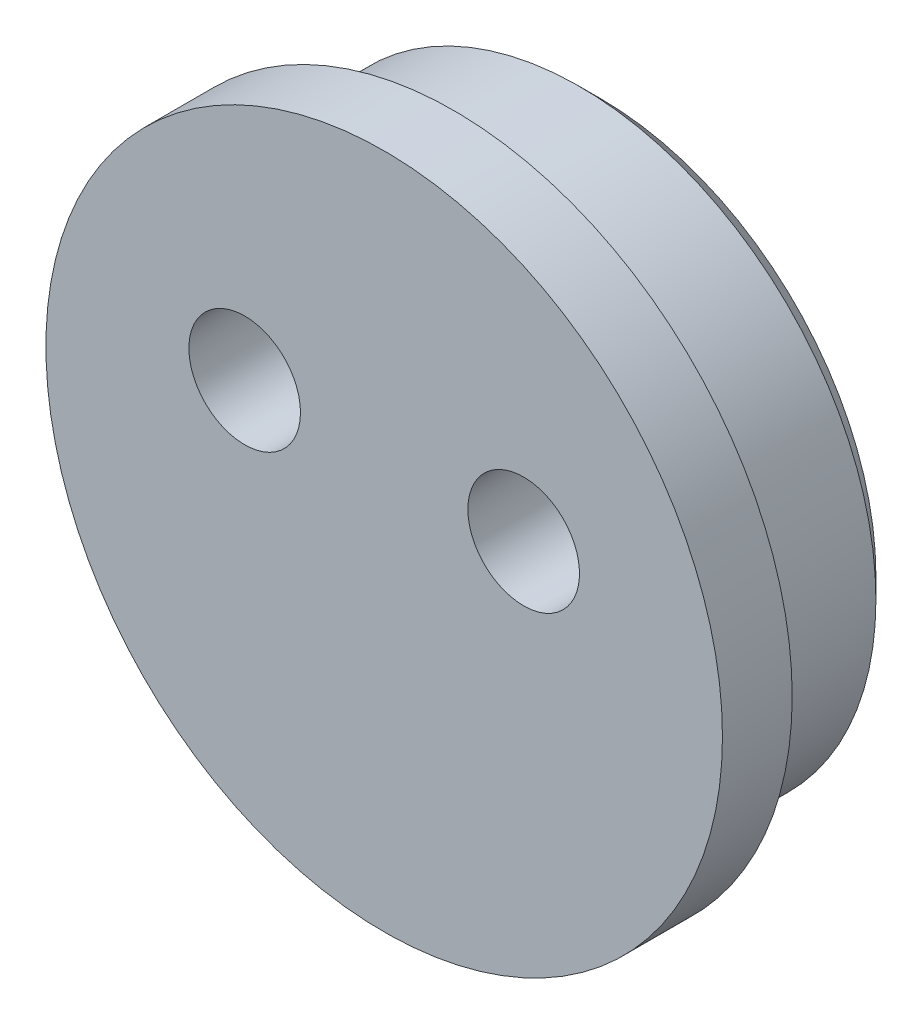
ISO-10303-21;
HEADER;
FILE_DESCRIPTION(('STEP AP214'),'2;1');
FILE_NAME('part.step','',(''),(''),'','','');
FILE_SCHEMA(('AUTOMOTIVE_DESIGN { 1 0 10303 214 1 1 1 1 }'));
ENDSEC;
DATA;
#1=APPLICATION_CONTEXT('core data for automotive mechanical design processes');
#2=APPLICATION_PROTOCOL_DEFINITION('international standard','automotive_design',2000,#1);
#3=PRODUCT_CONTEXT('',#1,'mechanical');
#4=PRODUCT('Part','Part','',(#3));
#5=PRODUCT_RELATED_PRODUCT_CATEGORY('part','',(#4));
#6=PRODUCT_DEFINITION_FORMATION('','',#4);
#7=PRODUCT_DEFINITION_CONTEXT('part definition',#1,'design');
#8=PRODUCT_DEFINITION('design','',#6,#7);
#9=PRODUCT_DEFINITION_SHAPE('','',#8);
#10=(LENGTH_UNIT() NAMED_UNIT(*) SI_UNIT(.MILLI.,.METRE.));
#11=(NAMED_UNIT(*) PLANE_ANGLE_UNIT() SI_UNIT($,.RADIAN.));
#12=(NAMED_UNIT(*) SI_UNIT($,.STERADIAN.) SOLID_ANGLE_UNIT());
#13=UNCERTAINTY_MEASURE_WITH_UNIT(LENGTH_MEASURE(1.E-05),#10,'distance_accuracy_value','');
#14=(GEOMETRIC_REPRESENTATION_CONTEXT(3) GLOBAL_UNCERTAINTY_ASSIGNED_CONTEXT((#13)) GLOBAL_UNIT_ASSIGNED_CONTEXT((#10,
#11,#12)) REPRESENTATION_CONTEXT('',''));
#15=CARTESIAN_POINT('',(0.,0.,0.));
#16=DIRECTION('',(0.,0.,1.));
#17=DIRECTION('',(1.,0.,0.));
#18=AXIS2_PLACEMENT_3D('',#15,#16,#17);
#19=CARTESIAN_POINT('',(0.,0.,6.2));
#20=DIRECTION('',(0.,0.,-1.));
#21=DIRECTION('',(-1.,0.,0.));
#22=AXIS2_PLACEMENT_3D('',#19,#20,#21);
#23=CYLINDRICAL_SURFACE('',#22,8.5);
#24=CARTESIAN_POINT('',(0.,0.,0.600000000000009));
#25=DIRECTION('',(0.,0.,1.));
#26=DIRECTION('',(1.,0.,0.));
#27=AXIS2_PLACEMENT_3D('',#24,#25,#26);
#28=CIRCLE('',#27,8.5);
#29=CARTESIAN_POINT('',(8.5,0.,0.600000000000009));
#30=VERTEX_POINT('',#29);
#31=EDGE_CURVE('E38',#30,#30,#28,.T.);
#32=ORIENTED_EDGE('',*,*,#31,.T.);
#33=EDGE_LOOP('',(#32));
#34=FACE_BOUND('',#33,.T.);
#35=CARTESIAN_POINT('',(0.,0.,4.2));
#36=DIRECTION('',(0.,0.,1.));
#37=DIRECTION('',(1.,0.,0.));
#38=AXIS2_PLACEMENT_3D('',#35,#36,#37);
#39=CIRCLE('',#38,8.5);
#40=CARTESIAN_POINT('',(8.5,0.,4.2));
#41=VERTEX_POINT('',#40);
#42=EDGE_CURVE('E42',#41,#41,#39,.T.);
#43=ORIENTED_EDGE('',*,*,#42,.F.);
#44=EDGE_LOOP('',(#43));
#45=FACE_BOUND('',#44,.T.);
#46=ADVANCED_FACE('F31',(#34,#45),#23,.T.);
#47=CARTESIAN_POINT('',(0.,0.,6.2));
#48=DIRECTION('',(0.,0.,1.));
#49=DIRECTION('',(1.,0.,0.));
#50=AXIS2_PLACEMENT_3D('',#47,#48,#49);
#51=PLANE('',#50);
#52=CARTESIAN_POINT('',(-4.,2.,6.2));
#53=DIRECTION('',(0.,0.,1.));
#54=DIRECTION('',(1.,0.,0.));
#55=AXIS2_PLACEMENT_3D('',#52,#53,#54);
#56=CIRCLE('',#55,1.6);
#57=CARTESIAN_POINT('',(-2.4,2.,6.2));
#58=VERTEX_POINT('',#57);
#59=EDGE_CURVE('E46',#58,#58,#56,.T.);
#60=ORIENTED_EDGE('',*,*,#59,.F.);
#61=EDGE_LOOP('',(#60));
#62=FACE_BOUND('',#61,.T.);
#63=CARTESIAN_POINT('',(4.,2.,6.2));
#64=DIRECTION('',(0.,0.,1.));
#65=DIRECTION('',(-1.,0.,0.));
#66=AXIS2_PLACEMENT_3D('',#63,#64,#65);
#67=CIRCLE('',#66,1.6);
#68=CARTESIAN_POINT('',(2.4,2.,6.2));
#69=VERTEX_POINT('',#68);
#70=EDGE_CURVE('E52',#69,#69,#67,.T.);
#71=ORIENTED_EDGE('',*,*,#70,.F.);
#72=EDGE_LOOP('',(#71));
#73=FACE_BOUND('',#72,.T.);
#74=CARTESIAN_POINT('',(0.,0.,6.2));
#75=DIRECTION('',(0.,0.,1.));
#76=DIRECTION('',(1.,0.,0.));
#77=AXIS2_PLACEMENT_3D('',#74,#75,#76);
#78=CIRCLE('',#77,9.7);
#79=CARTESIAN_POINT('',(9.7,0.,6.2));
#80=VERTEX_POINT('',#79);
#81=EDGE_CURVE('E61',#80,#80,#78,.T.);
#82=ORIENTED_EDGE('',*,*,#81,.T.);
#83=EDGE_LOOP('',(#82));
#84=FACE_BOUND('',#83,.T.);
#85=ADVANCED_FACE('F82',(#62,#73,#84),#51,.T.);
#86=CARTESIAN_POINT('',(0.,0.,0.));
#87=DIRECTION('',(0.,0.,1.));
#88=DIRECTION('',(1.,0.,0.));
#89=AXIS2_PLACEMENT_3D('',#86,#87,#88);
#90=PLANE('',#89);
#91=CARTESIAN_POINT('',(0.,0.,0.));
#92=DIRECTION('',(0.,0.,1.));
#93=DIRECTION('',(1.,0.,0.));
#94=AXIS2_PLACEMENT_3D('',#91,#92,#93);
#95=CIRCLE('',#94,7.89999999999999);
#96=CARTESIAN_POINT('',(7.89999999999999,0.,0.));
#97=VERTEX_POINT('',#96);
#98=EDGE_CURVE('E10',#97,#97,#95,.F.);
#99=ORIENTED_EDGE('',*,*,#98,.T.);
#100=EDGE_LOOP('',(#99));
#101=FACE_BOUND('',#100,.T.);
#102=CARTESIAN_POINT('',(-4.,2.,0.));
#103=DIRECTION('',(0.,0.,1.));
#104=DIRECTION('',(1.,0.,0.));
#105=AXIS2_PLACEMENT_3D('',#102,#103,#104);
#106=CIRCLE('',#105,1.6);
#107=CARTESIAN_POINT('',(-2.4,2.,0.));
#108=VERTEX_POINT('',#107);
#109=EDGE_CURVE('E49',#108,#108,#106,.T.);
#110=ORIENTED_EDGE('',*,*,#109,.T.);
#111=EDGE_LOOP('',(#110));
#112=FACE_BOUND('',#111,.T.);
#113=CARTESIAN_POINT('',(4.,2.,0.));
#114=DIRECTION('',(0.,0.,1.));
#115=DIRECTION('',(-1.,0.,0.));
#116=AXIS2_PLACEMENT_3D('',#113,#114,#115);
#117=CIRCLE('',#116,1.6);
#118=CARTESIAN_POINT('',(2.4,2.,0.));
#119=VERTEX_POINT('',#118);
#120=EDGE_CURVE('E55',#119,#119,#117,.T.);
#121=ORIENTED_EDGE('',*,*,#120,.T.);
#122=EDGE_LOOP('',(#121));
#123=FACE_BOUND('',#122,.T.);
#124=ADVANCED_FACE('F87',(#101,#112,#123),#90,.F.);
#125=CARTESIAN_POINT('',(-4.,2.,6.2));
#126=DIRECTION('',(0.,0.,-1.));
#127=DIRECTION('',(-1.,0.,0.));
#128=AXIS2_PLACEMENT_3D('',#125,#126,#127);
#129=CYLINDRICAL_SURFACE('',#128,1.6);
#130=ORIENTED_EDGE('',*,*,#59,.T.);
#131=EDGE_LOOP('',(#130));
#132=FACE_BOUND('',#131,.T.);
#133=ORIENTED_EDGE('',*,*,#109,.F.);
#134=EDGE_LOOP('',(#133));
#135=FACE_BOUND('',#134,.T.);
#136=ADVANCED_FACE('F92',(#132,#135),#129,.F.);
#137=CARTESIAN_POINT('',(4.,2.,6.2));
#138=DIRECTION('',(0.,0.,-1.));
#139=DIRECTION('',(-1.,0.,0.));
#140=AXIS2_PLACEMENT_3D('',#137,#138,#139);
#141=CYLINDRICAL_SURFACE('',#140,1.6);
#142=ORIENTED_EDGE('',*,*,#70,.T.);
#143=EDGE_LOOP('',(#142));
#144=FACE_BOUND('',#143,.T.);
#145=ORIENTED_EDGE('',*,*,#120,.F.);
#146=EDGE_LOOP('',(#145));
#147=FACE_BOUND('',#146,.T.);
#148=ADVANCED_FACE('F79',(#144,#147),#141,.F.);
#149=CARTESIAN_POINT('',(0.,0.,4.2));
#150=DIRECTION('',(0.,0.,1.));
#151=DIRECTION('',(1.,0.,0.));
#152=AXIS2_PLACEMENT_3D('',#149,#150,#151);
#153=CYLINDRICAL_SURFACE('',#152,9.7);
#154=CARTESIAN_POINT('',(0.,0.,4.2));
#155=DIRECTION('',(0.,0.,1.));
#156=DIRECTION('',(1.,0.,0.));
#157=AXIS2_PLACEMENT_3D('',#154,#155,#156);
#158=CIRCLE('',#157,9.7);
#159=CARTESIAN_POINT('',(9.7,0.,4.2));
#160=VERTEX_POINT('',#159);
#161=EDGE_CURVE('E58',#160,#160,#158,.T.);
#162=ORIENTED_EDGE('',*,*,#161,.T.);
#163=EDGE_LOOP('',(#162));
#164=FACE_BOUND('',#163,.T.);
#165=ORIENTED_EDGE('',*,*,#81,.F.);
#166=EDGE_LOOP('',(#165));
#167=FACE_BOUND('',#166,.T.);
#168=ADVANCED_FACE('F67',(#164,#167),#153,.T.);
#169=CARTESIAN_POINT('',(0.,0.,4.2));
#170=DIRECTION('',(0.,0.,1.));
#171=DIRECTION('',(1.,0.,0.));
#172=AXIS2_PLACEMENT_3D('',#169,#170,#171);
#173=PLANE('',#172);
#174=ORIENTED_EDGE('',*,*,#42,.T.);
#175=EDGE_LOOP('',(#174));
#176=FACE_BOUND('',#175,.T.);
#177=ORIENTED_EDGE('',*,*,#161,.F.);
#178=EDGE_LOOP('',(#177));
#179=FACE_BOUND('',#178,.T.);
#180=ADVANCED_FACE('F70',(#176,#179),#173,.F.);
#181=CARTESIAN_POINT('',(0.,0.,0.600000000000009));
#182=DIRECTION('',(0.,0.,1.));
#183=DIRECTION('',(1.,0.,0.));
#184=AXIS2_PLACEMENT_3D('',#181,#182,#183);
#185=CONICAL_SURFACE('',#184,8.5,0.78539816339745);
#186=ORIENTED_EDGE('',*,*,#98,.F.);
#187=EDGE_LOOP('',(#186));
#188=FACE_BOUND('',#187,.T.);
#189=ORIENTED_EDGE('',*,*,#31,.F.);
#190=EDGE_LOOP('',(#189));
#191=FACE_BOUND('',#190,.T.);
#192=ADVANCED_FACE('F33',(#188,#191),#185,.T.);
#193=CLOSED_SHELL('',(#46,#85,#124,#136,#148,#168,#180,#192));
#194=MANIFOLD_SOLID_BREP('B2',#193);
#195=ADVANCED_BREP_SHAPE_REPRESENTATION('',(#18,#194),#14);
#196=SHAPE_DEFINITION_REPRESENTATION(#9,#195);
ENDSEC;
END-ISO-10303-21;
